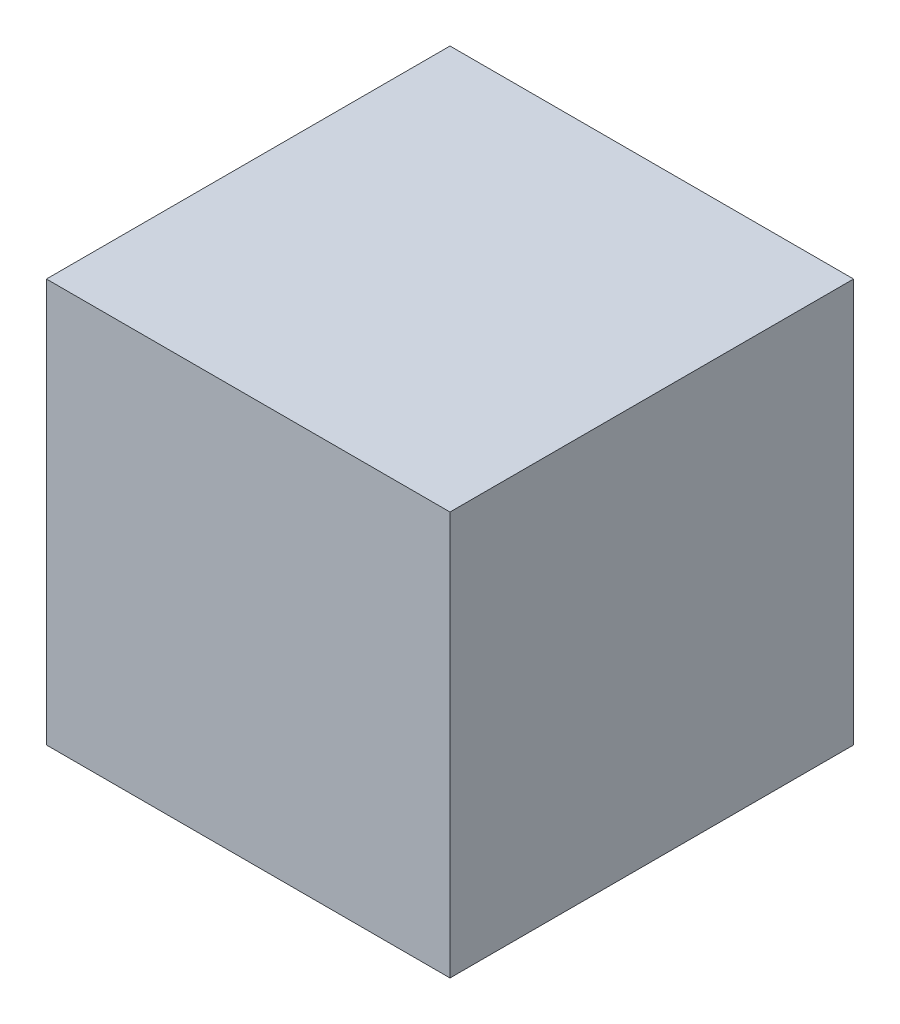
ISO-10303-21;
HEADER;
FILE_DESCRIPTION(('STEP AP214'),'2;1');
FILE_NAME('part.step','',(''),(''),'','','');
FILE_SCHEMA(('AUTOMOTIVE_DESIGN { 1 0 10303 214 1 1 1 1 }'));
ENDSEC;
DATA;
#1=APPLICATION_CONTEXT('core data for automotive mechanical design processes');
#2=APPLICATION_PROTOCOL_DEFINITION('international standard','automotive_design',2000,#1);
#3=PRODUCT_CONTEXT('',#1,'mechanical');
#4=PRODUCT('Part','Part','',(#3));
#5=PRODUCT_RELATED_PRODUCT_CATEGORY('part','',(#4));
#6=PRODUCT_DEFINITION_FORMATION('','',#4);
#7=PRODUCT_DEFINITION_CONTEXT('part definition',#1,'design');
#8=PRODUCT_DEFINITION('design','',#6,#7);
#9=PRODUCT_DEFINITION_SHAPE('','',#8);
#10=(LENGTH_UNIT() NAMED_UNIT(*) SI_UNIT(.MILLI.,.METRE.));
#11=(NAMED_UNIT(*) PLANE_ANGLE_UNIT() SI_UNIT($,.RADIAN.));
#12=(NAMED_UNIT(*) SI_UNIT($,.STERADIAN.) SOLID_ANGLE_UNIT());
#13=UNCERTAINTY_MEASURE_WITH_UNIT(LENGTH_MEASURE(1.E-05),#10,'distance_accuracy_value','');
#14=(GEOMETRIC_REPRESENTATION_CONTEXT(3) GLOBAL_UNCERTAINTY_ASSIGNED_CONTEXT((#13)) GLOBAL_UNIT_ASSIGNED_CONTEXT((#10,
#11,#12)) REPRESENTATION_CONTEXT('',''));
#15=CARTESIAN_POINT('',(0.,0.,0.));
#16=DIRECTION('',(0.,0.,1.));
#17=DIRECTION('',(1.,0.,0.));
#18=AXIS2_PLACEMENT_3D('',#15,#16,#17);
#19=CARTESIAN_POINT('',(15.875,31.75,15.875));
#20=DIRECTION('',(-1.,0.,0.));
#21=DIRECTION('',(0.,0.,1.));
#22=AXIS2_PLACEMENT_3D('',#19,#20,#21);
#23=PLANE('',#22);
#24=DIRECTION('',(0.,0.,-1.));
#25=VECTOR('',#24,1.);
#26=CARTESIAN_POINT('',(15.875,0.,15.875));
#27=LINE('',#26,#25);
#28=CARTESIAN_POINT('',(15.875,0.,15.875));
#29=VERTEX_POINT('',#28);
#30=CARTESIAN_POINT('',(15.875,0.,-15.875));
#31=VERTEX_POINT('',#30);
#32=EDGE_CURVE('E107',#29,#31,#27,.T.);
#33=ORIENTED_EDGE('',*,*,#32,.T.);
#34=DIRECTION('',(0.,-1.,0.));
#35=VECTOR('',#34,1.);
#36=CARTESIAN_POINT('',(15.875,31.75,-15.875));
#37=LINE('',#36,#35);
#38=CARTESIAN_POINT('',(15.875,31.75,-15.875));
#39=VERTEX_POINT('',#38);
#40=EDGE_CURVE('E11',#39,#31,#37,.T.);
#41=ORIENTED_EDGE('',*,*,#40,.F.);
#42=DIRECTION('',(0.,0.,-1.));
#43=VECTOR('',#42,1.);
#44=CARTESIAN_POINT('',(15.875,31.75,15.875));
#45=LINE('',#44,#43);
#46=CARTESIAN_POINT('',(15.875,31.75,15.875));
#47=VERTEX_POINT('',#46);
#48=EDGE_CURVE('E91',#47,#39,#45,.T.);
#49=ORIENTED_EDGE('',*,*,#48,.F.);
#50=DIRECTION('',(0.,-1.,0.));
#51=VECTOR('',#50,1.);
#52=CARTESIAN_POINT('',(15.875,31.75,15.875));
#53=LINE('',#52,#51);
#54=EDGE_CURVE('E103',#47,#29,#53,.T.);
#55=ORIENTED_EDGE('',*,*,#54,.T.);
#56=EDGE_LOOP('',(#33,#41,#49,#55));
#57=FACE_BOUND('',#56,.T.);
#58=ADVANCED_FACE('F39',(#57),#23,.F.);
#59=CARTESIAN_POINT('',(-15.875,31.75,-15.875));
#60=DIRECTION('',(0.,0.,1.));
#61=DIRECTION('',(1.,0.,0.));
#62=AXIS2_PLACEMENT_3D('',#59,#60,#61);
#63=PLANE('',#62);
#64=DIRECTION('',(-1.,0.,0.));
#65=VECTOR('',#64,1.);
#66=CARTESIAN_POINT('',(-15.875,0.,-15.875));
#67=LINE('',#66,#65);
#68=CARTESIAN_POINT('',(-15.875,0.,-15.875));
#69=VERTEX_POINT('',#68);
#70=EDGE_CURVE('E96',#31,#69,#67,.T.);
#71=ORIENTED_EDGE('',*,*,#70,.T.);
#72=DIRECTION('',(0.,-1.,0.));
#73=VECTOR('',#72,1.);
#74=CARTESIAN_POINT('',(-15.875,31.75,-15.875));
#75=LINE('',#74,#73);
#76=CARTESIAN_POINT('',(-15.875,31.75,-15.875));
#77=VERTEX_POINT('',#76);
#78=EDGE_CURVE('E48',#77,#69,#75,.T.);
#79=ORIENTED_EDGE('',*,*,#78,.F.);
#80=DIRECTION('',(-1.,0.,0.));
#81=VECTOR('',#80,1.);
#82=CARTESIAN_POINT('',(-15.875,31.75,-15.875));
#83=LINE('',#82,#81);
#84=EDGE_CURVE('E86',#39,#77,#83,.T.);
#85=ORIENTED_EDGE('',*,*,#84,.F.);
#86=ORIENTED_EDGE('',*,*,#40,.T.);
#87=EDGE_LOOP('',(#71,#79,#85,#86));
#88=FACE_BOUND('',#87,.T.);
#89=ADVANCED_FACE('F95',(#88),#63,.F.);
#90=CARTESIAN_POINT('',(-15.875,31.75,15.875));
#91=DIRECTION('',(1.,0.,0.));
#92=DIRECTION('',(0.,0.,-1.));
#93=AXIS2_PLACEMENT_3D('',#90,#91,#92);
#94=PLANE('',#93);
#95=DIRECTION('',(0.,0.,1.));
#96=VECTOR('',#95,1.);
#97=CARTESIAN_POINT('',(-15.875,0.,15.875));
#98=LINE('',#97,#96);
#99=CARTESIAN_POINT('',(-15.875,0.,15.875));
#100=VERTEX_POINT('',#99);
#101=EDGE_CURVE('E73',#69,#100,#98,.T.);
#102=ORIENTED_EDGE('',*,*,#101,.T.);
#103=DIRECTION('',(0.,-1.,0.));
#104=VECTOR('',#103,1.);
#105=CARTESIAN_POINT('',(-15.875,31.75,15.875));
#106=LINE('',#105,#104);
#107=CARTESIAN_POINT('',(-15.875,31.75,15.875));
#108=VERTEX_POINT('',#107);
#109=EDGE_CURVE('E98',#108,#100,#106,.T.);
#110=ORIENTED_EDGE('',*,*,#109,.F.);
#111=DIRECTION('',(0.,0.,1.));
#112=VECTOR('',#111,1.);
#113=CARTESIAN_POINT('',(-15.875,31.75,15.875));
#114=LINE('',#113,#112);
#115=EDGE_CURVE('E89',#77,#108,#114,.T.);
#116=ORIENTED_EDGE('',*,*,#115,.F.);
#117=ORIENTED_EDGE('',*,*,#78,.T.);
#118=EDGE_LOOP('',(#102,#110,#116,#117));
#119=FACE_BOUND('',#118,.T.);
#120=ADVANCED_FACE('F99',(#119),#94,.F.);
#121=CARTESIAN_POINT('',(-15.875,31.75,15.875));
#122=DIRECTION('',(0.,0.,-1.));
#123=DIRECTION('',(-1.,0.,0.));
#124=AXIS2_PLACEMENT_3D('',#121,#122,#123);
#125=PLANE('',#124);
#126=DIRECTION('',(1.,0.,0.));
#127=VECTOR('',#126,1.);
#128=CARTESIAN_POINT('',(-15.875,0.,15.875));
#129=LINE('',#128,#127);
#130=EDGE_CURVE('E79',#100,#29,#129,.T.);
#131=ORIENTED_EDGE('',*,*,#130,.T.);
#132=ORIENTED_EDGE('',*,*,#54,.F.);
#133=DIRECTION('',(1.,0.,0.));
#134=VECTOR('',#133,1.);
#135=CARTESIAN_POINT('',(-15.875,31.75,15.875));
#136=LINE('',#135,#134);
#137=EDGE_CURVE('E56',#108,#47,#136,.T.);
#138=ORIENTED_EDGE('',*,*,#137,.F.);
#139=ORIENTED_EDGE('',*,*,#109,.T.);
#140=EDGE_LOOP('',(#131,#132,#138,#139));
#141=FACE_BOUND('',#140,.T.);
#142=ADVANCED_FACE('F120',(#141),#125,.F.);
#143=CARTESIAN_POINT('',(0.,31.75,0.));
#144=DIRECTION('',(0.,-1.,0.));
#145=DIRECTION('',(0.,0.,-1.));
#146=AXIS2_PLACEMENT_3D('',#143,#144,#145);
#147=PLANE('',#146);
#148=ORIENTED_EDGE('',*,*,#48,.T.);
#149=ORIENTED_EDGE('',*,*,#84,.T.);
#150=ORIENTED_EDGE('',*,*,#115,.T.);
#151=ORIENTED_EDGE('',*,*,#137,.T.);
#152=EDGE_LOOP('',(#148,#149,#150,#151));
#153=FACE_BOUND('',#152,.T.);
#154=ADVANCED_FACE('F87',(#153),#147,.F.);
#155=CARTESIAN_POINT('',(0.,0.,0.));
#156=DIRECTION('',(0.,-1.,0.));
#157=DIRECTION('',(0.,0.,-1.));
#158=AXIS2_PLACEMENT_3D('',#155,#156,#157);
#159=PLANE('',#158);
#160=ORIENTED_EDGE('',*,*,#32,.F.);
#161=ORIENTED_EDGE('',*,*,#130,.F.);
#162=ORIENTED_EDGE('',*,*,#101,.F.);
#163=ORIENTED_EDGE('',*,*,#70,.F.);
#164=EDGE_LOOP('',(#160,#161,#162,#163));
#165=FACE_BOUND('',#164,.T.);
#166=ADVANCED_FACE('F123',(#165),#159,.T.);
#167=CLOSED_SHELL('',(#58,#89,#120,#142,#154,#166));
#168=MANIFOLD_SOLID_BREP('B2',#167);
#169=ADVANCED_BREP_SHAPE_REPRESENTATION('',(#18,#168),#14);
#170=SHAPE_DEFINITION_REPRESENTATION(#9,#169);
ENDSEC;
END-ISO-10303-21;
